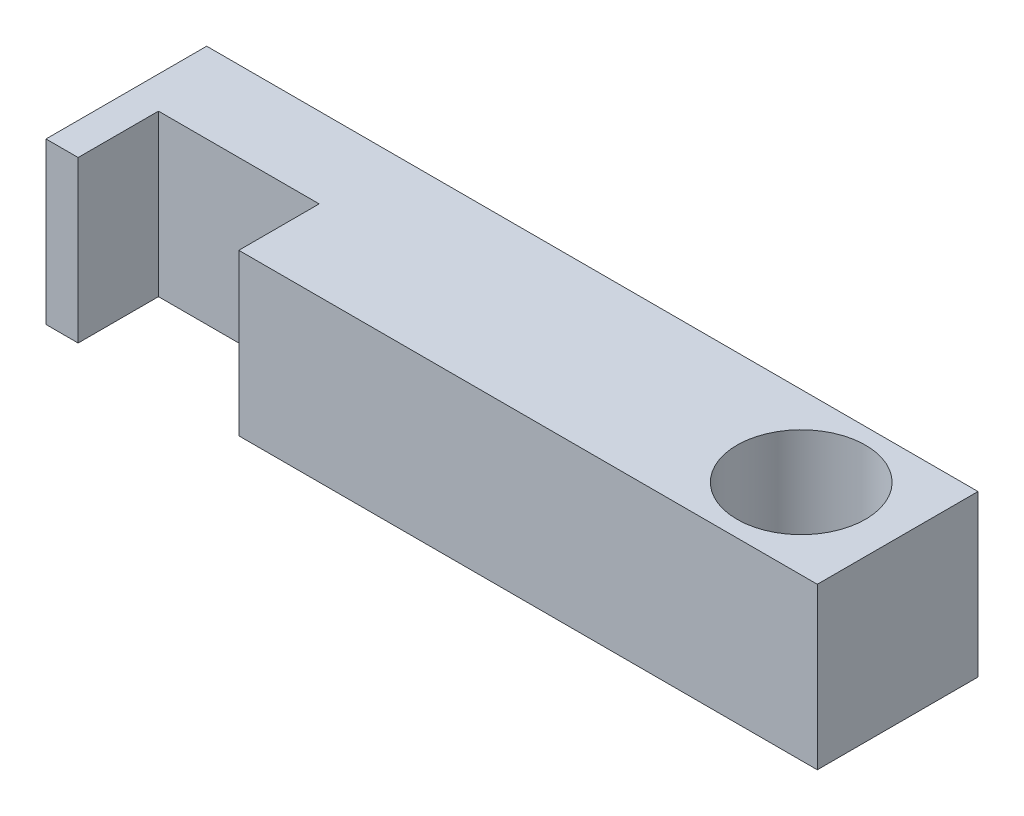
ISO-10303-21;
HEADER;
FILE_DESCRIPTION(('STEP AP214'),'2;1');
FILE_NAME('part.step','',(''),(''),'','','');
FILE_SCHEMA(('AUTOMOTIVE_DESIGN { 1 0 10303 214 1 1 1 1 }'));
ENDSEC;
DATA;
#1=APPLICATION_CONTEXT('core data for automotive mechanical design processes');
#2=APPLICATION_PROTOCOL_DEFINITION('international standard','automotive_design',2000,#1);
#3=PRODUCT_CONTEXT('',#1,'mechanical');
#4=PRODUCT('Part','Part','',(#3));
#5=PRODUCT_RELATED_PRODUCT_CATEGORY('part','',(#4));
#6=PRODUCT_DEFINITION_FORMATION('','',#4);
#7=PRODUCT_DEFINITION_CONTEXT('part definition',#1,'design');
#8=PRODUCT_DEFINITION('design','',#6,#7);
#9=PRODUCT_DEFINITION_SHAPE('','',#8);
#10=(LENGTH_UNIT() NAMED_UNIT(*) SI_UNIT(.MILLI.,.METRE.));
#11=(NAMED_UNIT(*) PLANE_ANGLE_UNIT() SI_UNIT($,.RADIAN.));
#12=(NAMED_UNIT(*) SI_UNIT($,.STERADIAN.) SOLID_ANGLE_UNIT());
#13=UNCERTAINTY_MEASURE_WITH_UNIT(LENGTH_MEASURE(1.E-05),#10,'distance_accuracy_value','');
#14=(GEOMETRIC_REPRESENTATION_CONTEXT(3) GLOBAL_UNCERTAINTY_ASSIGNED_CONTEXT((#13)) GLOBAL_UNIT_ASSIGNED_CONTEXT((#10,
#11,#12)) REPRESENTATION_CONTEXT('',''));
#15=CARTESIAN_POINT('',(0.,0.,0.));
#16=DIRECTION('',(0.,0.,1.));
#17=DIRECTION('',(1.,0.,0.));
#18=AXIS2_PLACEMENT_3D('',#15,#16,#17);
#19=CARTESIAN_POINT('',(0.,5.,0.));
#20=DIRECTION('',(0.,1.,0.));
#21=DIRECTION('',(0.,0.,1.));
#22=AXIS2_PLACEMENT_3D('',#19,#20,#21);
#23=PLANE('',#22);
#24=DIRECTION('',(0.,0.,1.));
#25=VECTOR('',#24,1.);
#26=CARTESIAN_POINT('',(-42.,5.,-5.));
#27=LINE('',#26,#25);
#28=CARTESIAN_POINT('',(-42.,5.,-5.));
#29=VERTEX_POINT('',#28);
#30=CARTESIAN_POINT('',(-42.,5.,5.));
#31=VERTEX_POINT('',#30);
#32=EDGE_CURVE('E164',#29,#31,#27,.T.);
#33=ORIENTED_EDGE('',*,*,#32,.T.);
#34=DIRECTION('',(1.,0.,0.));
#35=VECTOR('',#34,1.);
#36=CARTESIAN_POINT('',(-42.,5.,5.));
#37=LINE('',#36,#35);
#38=CARTESIAN_POINT('',(-40.,5.,5.));
#39=VERTEX_POINT('',#38);
#40=EDGE_CURVE('E100',#31,#39,#37,.T.);
#41=ORIENTED_EDGE('',*,*,#40,.T.);
#42=DIRECTION('',(0.,0.,-1.));
#43=VECTOR('',#42,1.);
#44=CARTESIAN_POINT('',(-40.,5.,5.));
#45=LINE('',#44,#43);
#46=CARTESIAN_POINT('',(-40.,5.,0.));
#47=VERTEX_POINT('',#46);
#48=EDGE_CURVE('E185',#39,#47,#45,.T.);
#49=ORIENTED_EDGE('',*,*,#48,.T.);
#50=DIRECTION('',(1.,0.,0.));
#51=VECTOR('',#50,1.);
#52=CARTESIAN_POINT('',(-40.,5.,0.));
#53=LINE('',#52,#51);
#54=CARTESIAN_POINT('',(-30.,5.,0.));
#55=VERTEX_POINT('',#54);
#56=EDGE_CURVE('E199',#47,#55,#53,.T.);
#57=ORIENTED_EDGE('',*,*,#56,.T.);
#58=DIRECTION('',(0.,0.,1.));
#59=VECTOR('',#58,1.);
#60=CARTESIAN_POINT('',(-30.,5.,0.));
#61=LINE('',#60,#59);
#62=CARTESIAN_POINT('',(-30.,5.,5.));
#63=VERTEX_POINT('',#62);
#64=EDGE_CURVE('E119',#55,#63,#61,.T.);
#65=ORIENTED_EDGE('',*,*,#64,.T.);
#66=DIRECTION('',(1.,0.,0.));
#67=VECTOR('',#66,1.);
#68=CARTESIAN_POINT('',(-30.,5.,5.));
#69=LINE('',#68,#67);
#70=CARTESIAN_POINT('',(6.,5.,5.));
#71=VERTEX_POINT('',#70);
#72=EDGE_CURVE('E113',#63,#71,#69,.T.);
#73=ORIENTED_EDGE('',*,*,#72,.T.);
#74=DIRECTION('',(0.,0.,-1.));
#75=VECTOR('',#74,1.);
#76=CARTESIAN_POINT('',(6.,5.,-5.));
#77=LINE('',#76,#75);
#78=CARTESIAN_POINT('',(6.,5.,-5.));
#79=VERTEX_POINT('',#78);
#80=EDGE_CURVE('E117',#71,#79,#77,.T.);
#81=ORIENTED_EDGE('',*,*,#80,.T.);
#82=DIRECTION('',(-1.,0.,0.));
#83=VECTOR('',#82,1.);
#84=CARTESIAN_POINT('',(-42.,5.,-5.));
#85=LINE('',#84,#83);
#86=EDGE_CURVE('E57',#79,#29,#85,.T.);
#87=ORIENTED_EDGE('',*,*,#86,.T.);
#88=EDGE_LOOP('',(#33,#41,#49,#57,#65,#73,#81,#87));
#89=FACE_BOUND('',#88,.T.);
#90=CARTESIAN_POINT('',(0.,5.,0.));
#91=DIRECTION('',(0.,1.,0.));
#92=DIRECTION('',(0.,0.,1.));
#93=AXIS2_PLACEMENT_3D('',#90,#91,#92);
#94=CIRCLE('',#93,4.);
#95=CARTESIAN_POINT('',(0.,5.,4.));
#96=VERTEX_POINT('',#95);
#97=EDGE_CURVE('E146',#96,#96,#94,.T.);
#98=ORIENTED_EDGE('',*,*,#97,.F.);
#99=EDGE_LOOP('',(#98));
#100=FACE_BOUND('',#99,.T.);
#101=ADVANCED_FACE('F39',(#89,#100),#23,.T.);
#102=CARTESIAN_POINT('',(0.,-5.,0.));
#103=DIRECTION('',(0.,1.,0.));
#104=DIRECTION('',(0.,0.,1.));
#105=AXIS2_PLACEMENT_3D('',#102,#103,#104);
#106=PLANE('',#105);
#107=DIRECTION('',(0.,0.,1.));
#108=VECTOR('',#107,1.);
#109=CARTESIAN_POINT('',(-42.,-5.,-5.));
#110=LINE('',#109,#108);
#111=CARTESIAN_POINT('',(-42.,-5.,-5.));
#112=VERTEX_POINT('',#111);
#113=CARTESIAN_POINT('',(-42.,-5.,5.));
#114=VERTEX_POINT('',#113);
#115=EDGE_CURVE('E141',#112,#114,#110,.T.);
#116=ORIENTED_EDGE('',*,*,#115,.F.);
#117=DIRECTION('',(-1.,0.,0.));
#118=VECTOR('',#117,1.);
#119=CARTESIAN_POINT('',(-42.,-5.,-5.));
#120=LINE('',#119,#118);
#121=CARTESIAN_POINT('',(6.,-5.,-5.));
#122=VERTEX_POINT('',#121);
#123=EDGE_CURVE('E92',#122,#112,#120,.T.);
#124=ORIENTED_EDGE('',*,*,#123,.F.);
#125=DIRECTION('',(0.,0.,-1.));
#126=VECTOR('',#125,1.);
#127=CARTESIAN_POINT('',(6.,-5.,-5.));
#128=LINE('',#127,#126);
#129=CARTESIAN_POINT('',(6.,-5.,5.));
#130=VERTEX_POINT('',#129);
#131=EDGE_CURVE('E86',#130,#122,#128,.T.);
#132=ORIENTED_EDGE('',*,*,#131,.F.);
#133=DIRECTION('',(1.,0.,0.));
#134=VECTOR('',#133,1.);
#135=CARTESIAN_POINT('',(-30.,-5.,5.));
#136=LINE('',#135,#134);
#137=CARTESIAN_POINT('',(-30.,-5.,5.));
#138=VERTEX_POINT('',#137);
#139=EDGE_CURVE('E128',#138,#130,#136,.T.);
#140=ORIENTED_EDGE('',*,*,#139,.F.);
#141=DIRECTION('',(0.,0.,1.));
#142=VECTOR('',#141,1.);
#143=CARTESIAN_POINT('',(-30.,-5.,0.));
#144=LINE('',#143,#142);
#145=CARTESIAN_POINT('',(-30.,-5.,0.));
#146=VERTEX_POINT('',#145);
#147=EDGE_CURVE('E155',#146,#138,#144,.T.);
#148=ORIENTED_EDGE('',*,*,#147,.F.);
#149=DIRECTION('',(1.,0.,0.));
#150=VECTOR('',#149,1.);
#151=CARTESIAN_POINT('',(-40.,-5.,0.));
#152=LINE('',#151,#150);
#153=CARTESIAN_POINT('',(-40.,-5.,0.));
#154=VERTEX_POINT('',#153);
#155=EDGE_CURVE('E152',#154,#146,#152,.T.);
#156=ORIENTED_EDGE('',*,*,#155,.F.);
#157=DIRECTION('',(0.,0.,-1.));
#158=VECTOR('',#157,1.);
#159=CARTESIAN_POINT('',(-40.,-5.,5.));
#160=LINE('',#159,#158);
#161=CARTESIAN_POINT('',(-40.,-5.,5.));
#162=VERTEX_POINT('',#161);
#163=EDGE_CURVE('E149',#162,#154,#160,.T.);
#164=ORIENTED_EDGE('',*,*,#163,.F.);
#165=DIRECTION('',(1.,0.,0.));
#166=VECTOR('',#165,1.);
#167=CARTESIAN_POINT('',(-42.,-5.,5.));
#168=LINE('',#167,#166);
#169=EDGE_CURVE('E145',#114,#162,#168,.T.);
#170=ORIENTED_EDGE('',*,*,#169,.F.);
#171=EDGE_LOOP('',(#116,#124,#132,#140,#148,#156,#164,#170));
#172=FACE_BOUND('',#171,.T.);
#173=CARTESIAN_POINT('',(0.,-5.,0.));
#174=DIRECTION('',(0.,1.,0.));
#175=DIRECTION('',(0.,0.,1.));
#176=AXIS2_PLACEMENT_3D('',#173,#174,#175);
#177=CIRCLE('',#176,4.);
#178=CARTESIAN_POINT('',(0.,-5.,4.));
#179=VERTEX_POINT('',#178);
#180=EDGE_CURVE('E209',#179,#179,#177,.T.);
#181=ORIENTED_EDGE('',*,*,#180,.T.);
#182=EDGE_LOOP('',(#181));
#183=FACE_BOUND('',#182,.T.);
#184=ADVANCED_FACE('F189',(#172,#183),#106,.F.);
#185=CARTESIAN_POINT('',(-42.,5.,-5.));
#186=DIRECTION('',(1.,0.,0.));
#187=DIRECTION('',(0.,0.,-1.));
#188=AXIS2_PLACEMENT_3D('',#185,#186,#187);
#189=PLANE('',#188);
#190=ORIENTED_EDGE('',*,*,#115,.T.);
#191=DIRECTION('',(0.,-1.,0.));
#192=VECTOR('',#191,1.);
#193=CARTESIAN_POINT('',(-42.,5.,5.));
#194=LINE('',#193,#192);
#195=EDGE_CURVE('E11',#31,#114,#194,.T.);
#196=ORIENTED_EDGE('',*,*,#195,.F.);
#197=ORIENTED_EDGE('',*,*,#32,.F.);
#198=DIRECTION('',(0.,-1.,0.));
#199=VECTOR('',#198,1.);
#200=CARTESIAN_POINT('',(-42.,5.,-5.));
#201=LINE('',#200,#199);
#202=EDGE_CURVE('E137',#29,#112,#201,.T.);
#203=ORIENTED_EDGE('',*,*,#202,.T.);
#204=EDGE_LOOP('',(#190,#196,#197,#203));
#205=FACE_BOUND('',#204,.T.);
#206=ADVANCED_FACE('F41',(#205),#189,.F.);
#207=CARTESIAN_POINT('',(-42.,5.,5.));
#208=DIRECTION('',(0.,0.,-1.));
#209=DIRECTION('',(-1.,0.,0.));
#210=AXIS2_PLACEMENT_3D('',#207,#208,#209);
#211=PLANE('',#210);
#212=ORIENTED_EDGE('',*,*,#169,.T.);
#213=DIRECTION('',(0.,-1.,0.));
#214=VECTOR('',#213,1.);
#215=CARTESIAN_POINT('',(-40.,5.,5.));
#216=LINE('',#215,#214);
#217=EDGE_CURVE('E49',#39,#162,#216,.T.);
#218=ORIENTED_EDGE('',*,*,#217,.F.);
#219=ORIENTED_EDGE('',*,*,#40,.F.);
#220=ORIENTED_EDGE('',*,*,#195,.T.);
#221=EDGE_LOOP('',(#212,#218,#219,#220));
#222=FACE_BOUND('',#221,.T.);
#223=ADVANCED_FACE('F239',(#222),#211,.F.);
#224=CARTESIAN_POINT('',(-40.,5.,5.));
#225=DIRECTION('',(-1.,0.,0.));
#226=DIRECTION('',(0.,0.,1.));
#227=AXIS2_PLACEMENT_3D('',#224,#225,#226);
#228=PLANE('',#227);
#229=ORIENTED_EDGE('',*,*,#163,.T.);
#230=DIRECTION('',(0.,-1.,0.));
#231=VECTOR('',#230,1.);
#232=CARTESIAN_POINT('',(-40.,5.,0.));
#233=LINE('',#232,#231);
#234=EDGE_CURVE('E175',#47,#154,#233,.T.);
#235=ORIENTED_EDGE('',*,*,#234,.F.);
#236=ORIENTED_EDGE('',*,*,#48,.F.);
#237=ORIENTED_EDGE('',*,*,#217,.T.);
#238=EDGE_LOOP('',(#229,#235,#236,#237));
#239=FACE_BOUND('',#238,.T.);
#240=ADVANCED_FACE('F183',(#239),#228,.F.);
#241=CARTESIAN_POINT('',(-40.,5.,0.));
#242=DIRECTION('',(0.,0.,-1.));
#243=DIRECTION('',(-1.,0.,0.));
#244=AXIS2_PLACEMENT_3D('',#241,#242,#243);
#245=PLANE('',#244);
#246=ORIENTED_EDGE('',*,*,#155,.T.);
#247=DIRECTION('',(0.,-1.,0.));
#248=VECTOR('',#247,1.);
#249=CARTESIAN_POINT('',(-30.,5.,0.));
#250=LINE('',#249,#248);
#251=EDGE_CURVE('E171',#55,#146,#250,.T.);
#252=ORIENTED_EDGE('',*,*,#251,.F.);
#253=ORIENTED_EDGE('',*,*,#56,.F.);
#254=ORIENTED_EDGE('',*,*,#234,.T.);
#255=EDGE_LOOP('',(#246,#252,#253,#254));
#256=FACE_BOUND('',#255,.T.);
#257=ADVANCED_FACE('F194',(#256),#245,.F.);
#258=CARTESIAN_POINT('',(-30.,5.,0.));
#259=DIRECTION('',(1.,0.,0.));
#260=DIRECTION('',(0.,0.,-1.));
#261=AXIS2_PLACEMENT_3D('',#258,#259,#260);
#262=PLANE('',#261);
#263=ORIENTED_EDGE('',*,*,#147,.T.);
#264=DIRECTION('',(0.,-1.,0.));
#265=VECTOR('',#264,1.);
#266=CARTESIAN_POINT('',(-30.,5.,5.));
#267=LINE('',#266,#265);
#268=EDGE_CURVE('E130',#63,#138,#267,.T.);
#269=ORIENTED_EDGE('',*,*,#268,.F.);
#270=ORIENTED_EDGE('',*,*,#64,.F.);
#271=ORIENTED_EDGE('',*,*,#251,.T.);
#272=EDGE_LOOP('',(#263,#269,#270,#271));
#273=FACE_BOUND('',#272,.T.);
#274=ADVANCED_FACE('F197',(#273),#262,.F.);
#275=CARTESIAN_POINT('',(-30.,5.,5.));
#276=DIRECTION('',(0.,0.,-1.));
#277=DIRECTION('',(-1.,0.,0.));
#278=AXIS2_PLACEMENT_3D('',#275,#276,#277);
#279=PLANE('',#278);
#280=ORIENTED_EDGE('',*,*,#139,.T.);
#281=DIRECTION('',(0.,-1.,0.));
#282=VECTOR('',#281,1.);
#283=CARTESIAN_POINT('',(6.,5.,5.));
#284=LINE('',#283,#282);
#285=EDGE_CURVE('E125',#71,#130,#284,.T.);
#286=ORIENTED_EDGE('',*,*,#285,.F.);
#287=ORIENTED_EDGE('',*,*,#72,.F.);
#288=ORIENTED_EDGE('',*,*,#268,.T.);
#289=EDGE_LOOP('',(#280,#286,#287,#288));
#290=FACE_BOUND('',#289,.T.);
#291=ADVANCED_FACE('F126',(#290),#279,.F.);
#292=CARTESIAN_POINT('',(6.,5.,-5.));
#293=DIRECTION('',(-1.,0.,0.));
#294=DIRECTION('',(0.,0.,1.));
#295=AXIS2_PLACEMENT_3D('',#292,#293,#294);
#296=PLANE('',#295);
#297=ORIENTED_EDGE('',*,*,#131,.T.);
#298=DIRECTION('',(0.,-1.,0.));
#299=VECTOR('',#298,1.);
#300=CARTESIAN_POINT('',(6.,5.,-5.));
#301=LINE('',#300,#299);
#302=EDGE_CURVE('E131',#79,#122,#301,.T.);
#303=ORIENTED_EDGE('',*,*,#302,.F.);
#304=ORIENTED_EDGE('',*,*,#80,.F.);
#305=ORIENTED_EDGE('',*,*,#285,.T.);
#306=EDGE_LOOP('',(#297,#303,#304,#305));
#307=FACE_BOUND('',#306,.T.);
#308=ADVANCED_FACE('F133',(#307),#296,.F.);
#309=CARTESIAN_POINT('',(-42.,5.,-5.));
#310=DIRECTION('',(0.,0.,1.));
#311=DIRECTION('',(1.,0.,0.));
#312=AXIS2_PLACEMENT_3D('',#309,#310,#311);
#313=PLANE('',#312);
#314=ORIENTED_EDGE('',*,*,#123,.T.);
#315=ORIENTED_EDGE('',*,*,#202,.F.);
#316=ORIENTED_EDGE('',*,*,#86,.F.);
#317=ORIENTED_EDGE('',*,*,#302,.T.);
#318=EDGE_LOOP('',(#314,#315,#316,#317));
#319=FACE_BOUND('',#318,.T.);
#320=ADVANCED_FACE('F227',(#319),#313,.F.);
#321=CARTESIAN_POINT('',(0.,5.,0.));
#322=DIRECTION('',(0.,-1.,0.));
#323=DIRECTION('',(0.,0.,-1.));
#324=AXIS2_PLACEMENT_3D('',#321,#322,#323);
#325=CYLINDRICAL_SURFACE('',#324,4.);
#326=ORIENTED_EDGE('',*,*,#97,.T.);
#327=EDGE_LOOP('',(#326));
#328=FACE_BOUND('',#327,.T.);
#329=ORIENTED_EDGE('',*,*,#180,.F.);
#330=EDGE_LOOP('',(#329));
#331=FACE_BOUND('',#330,.T.);
#332=ADVANCED_FACE('F217',(#328,#331),#325,.F.);
#333=CLOSED_SHELL('',(#101,#184,#206,#223,#240,#257,#274,#291,#308,#320,#332));
#334=MANIFOLD_SOLID_BREP('B2',#333);
#335=ADVANCED_BREP_SHAPE_REPRESENTATION('',(#18,#334),#14);
#336=SHAPE_DEFINITION_REPRESENTATION(#9,#335);
ENDSEC;
END-ISO-10303-21;
